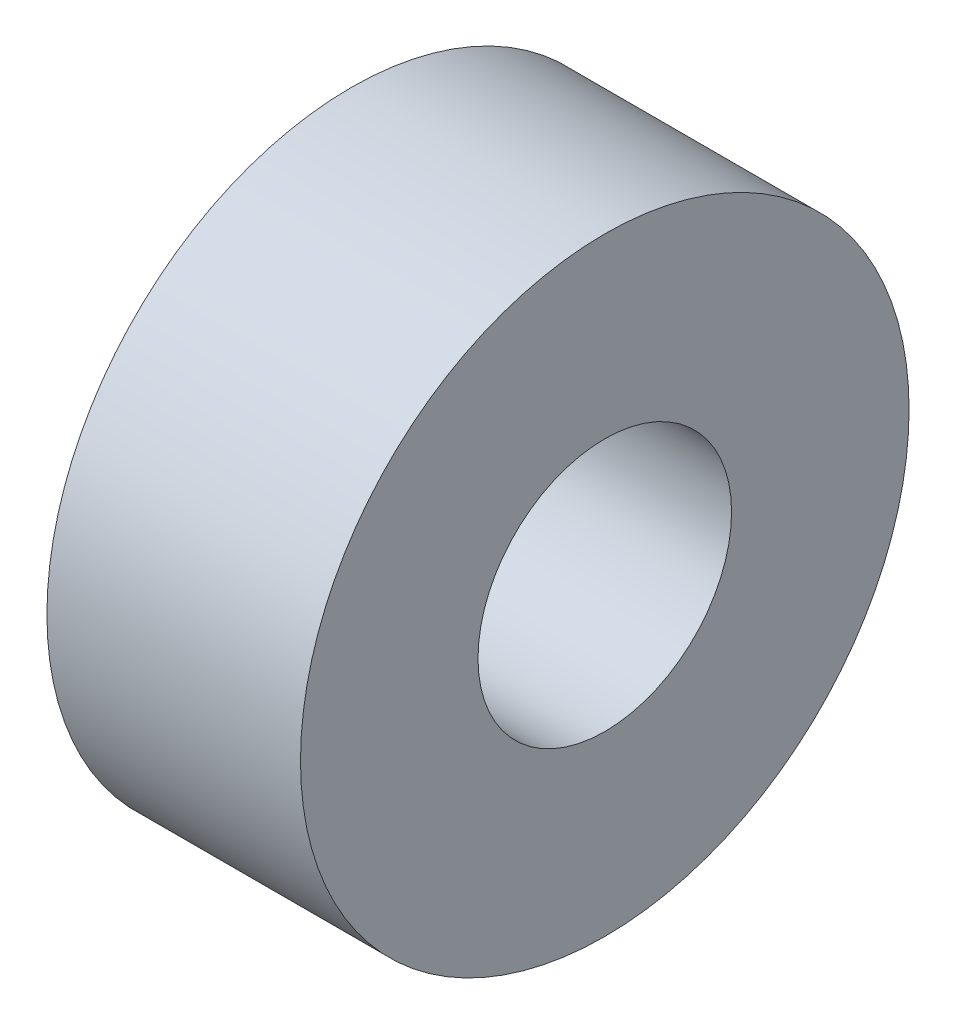
ISO-10303-21;
HEADER;
FILE_DESCRIPTION(('STEP AP214'),'2;1');
FILE_NAME('part.step','',(''),(''),'','','');
FILE_SCHEMA(('AUTOMOTIVE_DESIGN { 1 0 10303 214 1 1 1 1 }'));
ENDSEC;
DATA;
#1=APPLICATION_CONTEXT('core data for automotive mechanical design processes');
#2=APPLICATION_PROTOCOL_DEFINITION('international standard','automotive_design',2000,#1);
#3=PRODUCT_CONTEXT('',#1,'mechanical');
#4=PRODUCT('Part','Part','',(#3));
#5=PRODUCT_RELATED_PRODUCT_CATEGORY('part','',(#4));
#6=PRODUCT_DEFINITION_FORMATION('','',#4);
#7=PRODUCT_DEFINITION_CONTEXT('part definition',#1,'design');
#8=PRODUCT_DEFINITION('design','',#6,#7);
#9=PRODUCT_DEFINITION_SHAPE('','',#8);
#10=(LENGTH_UNIT() NAMED_UNIT(*) SI_UNIT(.MILLI.,.METRE.));
#11=(NAMED_UNIT(*) PLANE_ANGLE_UNIT() SI_UNIT($,.RADIAN.));
#12=(NAMED_UNIT(*) SI_UNIT($,.STERADIAN.) SOLID_ANGLE_UNIT());
#13=UNCERTAINTY_MEASURE_WITH_UNIT(LENGTH_MEASURE(1.E-05),#10,'distance_accuracy_value','');
#14=(GEOMETRIC_REPRESENTATION_CONTEXT(3) GLOBAL_UNCERTAINTY_ASSIGNED_CONTEXT((#13)) GLOBAL_UNIT_ASSIGNED_CONTEXT((#10,
#11,#12)) REPRESENTATION_CONTEXT('',''));
#15=CARTESIAN_POINT('',(0.,0.,0.));
#16=DIRECTION('',(0.,0.,1.));
#17=DIRECTION('',(1.,0.,0.));
#18=AXIS2_PLACEMENT_3D('',#15,#16,#17);
#19=CARTESIAN_POINT('',(5.,0.,0.));
#20=DIRECTION('',(1.,0.,0.));
#21=DIRECTION('',(0.,0.,-1.));
#22=AXIS2_PLACEMENT_3D('',#19,#20,#21);
#23=PLANE('',#22);
#24=CARTESIAN_POINT('',(5.,0.,0.));
#25=DIRECTION('',(1.,0.,0.));
#26=DIRECTION('',(0.,0.,-1.));
#27=AXIS2_PLACEMENT_3D('',#24,#25,#26);
#28=CIRCLE('',#27,6.);
#29=CARTESIAN_POINT('',(5.,0.,-6.));
#30=VERTEX_POINT('',#29);
#31=EDGE_CURVE('E10',#30,#30,#28,.T.);
#32=ORIENTED_EDGE('',*,*,#31,.T.);
#33=EDGE_LOOP('',(#32));
#34=FACE_BOUND('',#33,.T.);
#35=CARTESIAN_POINT('',(5.,0.,0.));
#36=DIRECTION('',(1.,0.,0.));
#37=DIRECTION('',(0.,0.,-1.));
#38=AXIS2_PLACEMENT_3D('',#35,#36,#37);
#39=CIRCLE('',#38,2.5);
#40=CARTESIAN_POINT('',(5.,0.,-2.5));
#41=VERTEX_POINT('',#40);
#42=EDGE_CURVE('E44',#41,#41,#39,.T.);
#43=ORIENTED_EDGE('',*,*,#42,.F.);
#44=EDGE_LOOP('',(#43));
#45=FACE_BOUND('',#44,.T.);
#46=ADVANCED_FACE('F33',(#34,#45),#23,.T.);
#47=CARTESIAN_POINT('',(0.,0.,0.));
#48=DIRECTION('',(1.,0.,0.));
#49=DIRECTION('',(0.,0.,-1.));
#50=AXIS2_PLACEMENT_3D('',#47,#48,#49);
#51=PLANE('',#50);
#52=CARTESIAN_POINT('',(0.,0.,0.));
#53=DIRECTION('',(1.,0.,0.));
#54=DIRECTION('',(0.,0.,-1.));
#55=AXIS2_PLACEMENT_3D('',#52,#53,#54);
#56=CIRCLE('',#55,6.);
#57=CARTESIAN_POINT('',(0.,0.,-6.));
#58=VERTEX_POINT('',#57);
#59=EDGE_CURVE('E37',#58,#58,#56,.T.);
#60=ORIENTED_EDGE('',*,*,#59,.F.);
#61=EDGE_LOOP('',(#60));
#62=FACE_BOUND('',#61,.T.);
#63=CARTESIAN_POINT('',(0.,0.,0.));
#64=DIRECTION('',(1.,0.,0.));
#65=DIRECTION('',(0.,0.,-1.));
#66=AXIS2_PLACEMENT_3D('',#63,#64,#65);
#67=CIRCLE('',#66,2.5);
#68=CARTESIAN_POINT('',(0.,0.,-2.5));
#69=VERTEX_POINT('',#68);
#70=EDGE_CURVE('E46',#69,#69,#67,.T.);
#71=ORIENTED_EDGE('',*,*,#70,.T.);
#72=EDGE_LOOP('',(#71));
#73=FACE_BOUND('',#72,.T.);
#74=ADVANCED_FACE('F56',(#62,#73),#51,.F.);
#75=CARTESIAN_POINT('',(5.,0.,0.));
#76=DIRECTION('',(-1.,0.,0.));
#77=DIRECTION('',(0.,0.,1.));
#78=AXIS2_PLACEMENT_3D('',#75,#76,#77);
#79=CYLINDRICAL_SURFACE('',#78,6.);
#80=ORIENTED_EDGE('',*,*,#31,.F.);
#81=EDGE_LOOP('',(#80));
#82=FACE_BOUND('',#81,.T.);
#83=ORIENTED_EDGE('',*,*,#59,.T.);
#84=EDGE_LOOP('',(#83));
#85=FACE_BOUND('',#84,.T.);
#86=ADVANCED_FACE('F35',(#82,#85),#79,.T.);
#87=CARTESIAN_POINT('',(5.,0.,0.));
#88=DIRECTION('',(-1.,0.,0.));
#89=DIRECTION('',(0.,0.,1.));
#90=AXIS2_PLACEMENT_3D('',#87,#88,#89);
#91=CYLINDRICAL_SURFACE('',#90,2.5);
#92=ORIENTED_EDGE('',*,*,#42,.T.);
#93=EDGE_LOOP('',(#92));
#94=FACE_BOUND('',#93,.T.);
#95=ORIENTED_EDGE('',*,*,#70,.F.);
#96=EDGE_LOOP('',(#95));
#97=FACE_BOUND('',#96,.T.);
#98=ADVANCED_FACE('F52',(#94,#97),#91,.F.);
#99=CLOSED_SHELL('',(#46,#74,#86,#98));
#100=MANIFOLD_SOLID_BREP('B2',#99);
#101=ADVANCED_BREP_SHAPE_REPRESENTATION('',(#18,#100),#14);
#102=SHAPE_DEFINITION_REPRESENTATION(#9,#101);
ENDSEC;
END-ISO-10303-21;
